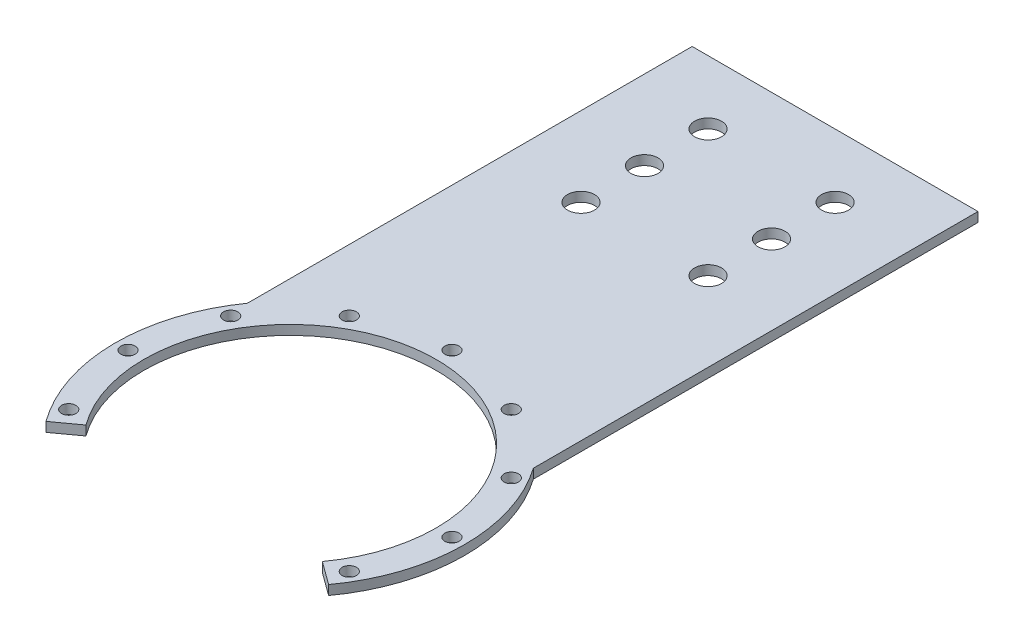
ISO-10303-21;
HEADER;
FILE_DESCRIPTION(('STEP AP214'),'2;1');
FILE_NAME('part.step','',(''),(''),'','','');
FILE_SCHEMA(('AUTOMOTIVE_DESIGN { 1 0 10303 214 1 1 1 1 }'));
ENDSEC;
DATA;
#1=APPLICATION_CONTEXT('core data for automotive mechanical design processes');
#2=APPLICATION_PROTOCOL_DEFINITION('international standard','automotive_design',2000,#1);
#3=PRODUCT_CONTEXT('',#1,'mechanical');
#4=PRODUCT('Part','Part','',(#3));
#5=PRODUCT_RELATED_PRODUCT_CATEGORY('part','',(#4));
#6=PRODUCT_DEFINITION_FORMATION('','',#4);
#7=PRODUCT_DEFINITION_CONTEXT('part definition',#1,'design');
#8=PRODUCT_DEFINITION('design','',#6,#7);
#9=PRODUCT_DEFINITION_SHAPE('','',#8);
#10=(LENGTH_UNIT() NAMED_UNIT(*) SI_UNIT(.MILLI.,.METRE.));
#11=(NAMED_UNIT(*) PLANE_ANGLE_UNIT() SI_UNIT($,.RADIAN.));
#12=(NAMED_UNIT(*) SI_UNIT($,.STERADIAN.) SOLID_ANGLE_UNIT());
#13=UNCERTAINTY_MEASURE_WITH_UNIT(LENGTH_MEASURE(1.E-05),#10,'distance_accuracy_value','');
#14=(GEOMETRIC_REPRESENTATION_CONTEXT(3) GLOBAL_UNCERTAINTY_ASSIGNED_CONTEXT((#13)) GLOBAL_UNIT_ASSIGNED_CONTEXT((#10,
#11,#12)) REPRESENTATION_CONTEXT('',''));
#15=CARTESIAN_POINT('',(0.,0.,0.));
#16=DIRECTION('',(0.,0.,1.));
#17=DIRECTION('',(1.,0.,0.));
#18=AXIS2_PLACEMENT_3D('',#15,#16,#17);
#19=CARTESIAN_POINT('',(-20.,-0.000287499999999594,-111.622776601684));
#20=DIRECTION('',(0.,1.,0.));
#21=DIRECTION('',(0.,0.,1.));
#22=AXIS2_PLACEMENT_3D('',#19,#20,#21);
#23=CYLINDRICAL_SURFACE('',#22,4.25);
#24=CARTESIAN_POINT('',(-20.,3.,-111.622776601684));
#25=DIRECTION('',(0.,1.,0.));
#26=DIRECTION('',(0.,0.,1.));
#27=AXIS2_PLACEMENT_3D('',#24,#25,#26);
#28=CIRCLE('',#27,4.25);
#29=CARTESIAN_POINT('',(-20.,3.,-107.372776601684));
#30=VERTEX_POINT('',#29);
#31=EDGE_CURVE('E40',#30,#30,#28,.T.);
#32=ORIENTED_EDGE('',*,*,#31,.T.);
#33=EDGE_LOOP('',(#32));
#34=FACE_BOUND('',#33,.T.);
#35=CARTESIAN_POINT('',(-20.,0.,-111.622776601684));
#36=DIRECTION('',(0.,1.,0.));
#37=DIRECTION('',(0.,0.,1.));
#38=AXIS2_PLACEMENT_3D('',#35,#36,#37);
#39=CIRCLE('',#38,4.25);
#40=CARTESIAN_POINT('',(-20.,0.,-107.372776601684));
#41=VERTEX_POINT('',#40);
#42=EDGE_CURVE('E11',#41,#41,#39,.T.);
#43=ORIENTED_EDGE('',*,*,#42,.F.);
#44=EDGE_LOOP('',(#43));
#45=FACE_BOUND('',#44,.T.);
#46=ADVANCED_FACE('F33',(#34,#45),#23,.F.);
#47=CARTESIAN_POINT('',(20.,-0.000287499999999594,-111.622776601684));
#48=DIRECTION('',(0.,1.,0.));
#49=DIRECTION('',(0.,0.,1.));
#50=AXIS2_PLACEMENT_3D('',#47,#48,#49);
#51=CYLINDRICAL_SURFACE('',#50,4.25);
#52=CARTESIAN_POINT('',(20.,3.,-111.622776601684));
#53=DIRECTION('',(0.,1.,0.));
#54=DIRECTION('',(0.,0.,1.));
#55=AXIS2_PLACEMENT_3D('',#52,#53,#54);
#56=CIRCLE('',#55,4.25);
#57=CARTESIAN_POINT('',(20.,3.,-107.372776601684));
#58=VERTEX_POINT('',#57);
#59=EDGE_CURVE('E144',#58,#58,#56,.T.);
#60=ORIENTED_EDGE('',*,*,#59,.T.);
#61=EDGE_LOOP('',(#60));
#62=FACE_BOUND('',#61,.T.);
#63=CARTESIAN_POINT('',(20.,0.,-111.622776601684));
#64=DIRECTION('',(0.,1.,0.));
#65=DIRECTION('',(0.,0.,1.));
#66=AXIS2_PLACEMENT_3D('',#63,#64,#65);
#67=CIRCLE('',#66,4.25);
#68=CARTESIAN_POINT('',(20.,0.,-107.372776601684));
#69=VERTEX_POINT('',#68);
#70=EDGE_CURVE('E146',#69,#69,#67,.T.);
#71=ORIENTED_EDGE('',*,*,#70,.F.);
#72=EDGE_LOOP('',(#71));
#73=FACE_BOUND('',#72,.T.);
#74=ADVANCED_FACE('F171',(#62,#73),#51,.F.);
#75=CARTESIAN_POINT('',(0.,3.,0.));
#76=DIRECTION('',(0.,-1.,0.));
#77=DIRECTION('',(0.,0.,-1.));
#78=AXIS2_PLACEMENT_3D('',#75,#76,#77);
#79=CYLINDRICAL_SURFACE('',#78,55.);
#80=DIRECTION('',(0.,1.,0.));
#81=VECTOR('',#80,1.);
#82=CARTESIAN_POINT('',(44.4959346906222,-2.49999999998515E-05,32.328188876086));
#83=LINE('',#82,#81);
#84=CARTESIAN_POINT('',(44.4959346906222,-6.24999999996288E-06,32.328188876086));
#85=VERTEX_POINT('',#84);
#86=CARTESIAN_POINT('',(44.4959346906222,3.,32.328188876086));
#87=VERTEX_POINT('',#86);
#88=EDGE_CURVE('E97',#85,#87,#83,.T.);
#89=ORIENTED_EDGE('',*,*,#88,.F.);
#90=CARTESIAN_POINT('',(0.,0.,0.));
#91=DIRECTION('',(0.,1.,0.));
#92=DIRECTION('',(0.,0.,1.));
#93=AXIS2_PLACEMENT_3D('',#90,#91,#92);
#94=CIRCLE('',#93,55.);
#95=CARTESIAN_POINT('',(45.,0.,-31.6227766016838));
#96=VERTEX_POINT('',#95);
#97=EDGE_CURVE('E126',#85,#96,#94,.T.);
#98=ORIENTED_EDGE('',*,*,#97,.T.);
#99=DIRECTION('',(0.,-1.,0.));
#100=VECTOR('',#99,1.);
#101=CARTESIAN_POINT('',(45.,3.,-31.6227766016838));
#102=LINE('',#101,#100);
#103=CARTESIAN_POINT('',(45.,3.,-31.6227766016838));
#104=VERTEX_POINT('',#103);
#105=EDGE_CURVE('E117',#104,#96,#102,.T.);
#106=ORIENTED_EDGE('',*,*,#105,.F.);
#107=CARTESIAN_POINT('',(0.,3.,0.));
#108=DIRECTION('',(0.,1.,0.));
#109=DIRECTION('',(0.,0.,1.));
#110=AXIS2_PLACEMENT_3D('',#107,#108,#109);
#111=CIRCLE('',#110,55.);
#112=EDGE_CURVE('E109',#87,#104,#111,.T.);
#113=ORIENTED_EDGE('',*,*,#112,.F.);
#114=EDGE_LOOP('',(#89,#98,#106,#113));
#115=FACE_BOUND('',#114,.T.);
#116=ADVANCED_FACE('F115',(#115),#79,.T.);
#117=CARTESIAN_POINT('',(0.,3.,0.));
#118=DIRECTION('',(0.,1.,0.));
#119=DIRECTION('',(0.,0.,1.));
#120=AXIS2_PLACEMENT_3D('',#117,#118,#119);
#121=PLANE('',#120);
#122=CARTESIAN_POINT('',(-20.,3.,-131.622776601684));
#123=DIRECTION('',(0.,1.,0.));
#124=DIRECTION('',(0.,0.,1.));
#125=AXIS2_PLACEMENT_3D('',#122,#123,#124);
#126=CIRCLE('',#125,4.25);
#127=CARTESIAN_POINT('',(-20.,3.,-127.372776601684));
#128=VERTEX_POINT('',#127);
#129=EDGE_CURVE('E549',#128,#128,#126,.T.);
#130=ORIENTED_EDGE('',*,*,#129,.F.);
#131=EDGE_LOOP('',(#130));
#132=FACE_BOUND('',#131,.T.);
#133=CARTESIAN_POINT('',(20.,3.,-131.622776601684));
#134=DIRECTION('',(0.,1.,0.));
#135=DIRECTION('',(0.,0.,1.));
#136=AXIS2_PLACEMENT_3D('',#133,#134,#135);
#137=CIRCLE('',#136,4.25);
#138=CARTESIAN_POINT('',(20.,3.,-127.372776601684));
#139=VERTEX_POINT('',#138);
#140=EDGE_CURVE('E447',#139,#139,#137,.T.);
#141=ORIENTED_EDGE('',*,*,#140,.F.);
#142=EDGE_LOOP('',(#141));
#143=FACE_BOUND('',#142,.T.);
#144=CARTESIAN_POINT('',(20.,3.,-151.622776601684));
#145=DIRECTION('',(0.,1.,0.));
#146=DIRECTION('',(0.,0.,1.));
#147=AXIS2_PLACEMENT_3D('',#144,#145,#146);
#148=CIRCLE('',#147,4.25);
#149=CARTESIAN_POINT('',(20.,3.,-147.372776601684));
#150=VERTEX_POINT('',#149);
#151=EDGE_CURVE('E411',#150,#150,#148,.T.);
#152=ORIENTED_EDGE('',*,*,#151,.F.);
#153=EDGE_LOOP('',(#152));
#154=FACE_BOUND('',#153,.T.);
#155=CARTESIAN_POINT('',(-20.,3.,-151.622776601684));
#156=DIRECTION('',(0.,1.,0.));
#157=DIRECTION('',(0.,0.,1.));
#158=AXIS2_PLACEMENT_3D('',#155,#156,#157);
#159=CIRCLE('',#158,4.25);
#160=CARTESIAN_POINT('',(-20.,3.,-147.372776601684));
#161=VERTEX_POINT('',#160);
#162=EDGE_CURVE('E440',#161,#161,#159,.T.);
#163=ORIENTED_EDGE('',*,*,#162,.F.);
#164=EDGE_LOOP('',(#163));
#165=FACE_BOUND('',#164,.T.);
#166=CARTESIAN_POINT('',(-44.1672955930064,3.,-25.4999999999999));
#167=DIRECTION('',(0.,1.,0.));
#168=DIRECTION('',(0.,0.,1.));
#169=AXIS2_PLACEMENT_3D('',#166,#167,#168);
#170=CIRCLE('',#169,2.25);
#171=CARTESIAN_POINT('',(-44.1672955930064,3.,-23.2499999999999));
#172=VERTEX_POINT('',#171);
#173=EDGE_CURVE('E406',#172,#172,#170,.T.);
#174=ORIENTED_EDGE('',*,*,#173,.F.);
#175=EDGE_LOOP('',(#174));
#176=FACE_BOUND('',#175,.T.);
#177=CARTESIAN_POINT('',(-51.,3.,1.78065548281E-13));
#178=DIRECTION('',(0.,1.,0.));
#179=DIRECTION('',(0.,0.,1.));
#180=AXIS2_PLACEMENT_3D('',#177,#178,#179);
#181=CIRCLE('',#180,2.25);
#182=CARTESIAN_POINT('',(-51.,3.,2.25000000000018));
#183=VERTEX_POINT('',#182);
#184=EDGE_CURVE('E435',#183,#183,#181,.T.);
#185=ORIENTED_EDGE('',*,*,#184,.F.);
#186=EDGE_LOOP('',(#185));
#187=FACE_BOUND('',#186,.T.);
#188=CARTESIAN_POINT('',(-44.1672955930063,3.,25.5000000000002));
#189=DIRECTION('',(0.,1.,0.));
#190=DIRECTION('',(0.,0.,1.));
#191=AXIS2_PLACEMENT_3D('',#188,#189,#190);
#192=CIRCLE('',#191,2.25);
#193=CARTESIAN_POINT('',(-44.1672955930063,3.,27.7500000000002));
#194=VERTEX_POINT('',#193);
#195=EDGE_CURVE('E431',#194,#194,#192,.T.);
#196=ORIENTED_EDGE('',*,*,#195,.F.);
#197=EDGE_LOOP('',(#196));
#198=FACE_BOUND('',#197,.T.);
#199=CARTESIAN_POINT('',(44.1672955930066,3.,25.4999999999996));
#200=DIRECTION('',(0.,1.,0.));
#201=DIRECTION('',(0.,0.,1.));
#202=AXIS2_PLACEMENT_3D('',#199,#200,#201);
#203=CIRCLE('',#202,2.25);
#204=CARTESIAN_POINT('',(44.1672955930066,3.,27.7499999999996));
#205=VERTEX_POINT('',#204);
#206=EDGE_CURVE('E427',#205,#205,#203,.T.);
#207=ORIENTED_EDGE('',*,*,#206,.F.);
#208=EDGE_LOOP('',(#207));
#209=FACE_BOUND('',#208,.T.);
#210=CARTESIAN_POINT('',(51.,3.,-5.34196644842999E-13));
#211=DIRECTION('',(0.,1.,0.));
#212=DIRECTION('',(0.,0.,1.));
#213=AXIS2_PLACEMENT_3D('',#210,#211,#212);
#214=CIRCLE('',#213,2.25);
#215=CARTESIAN_POINT('',(51.,3.,2.24999999999947));
#216=VERTEX_POINT('',#215);
#217=EDGE_CURVE('E423',#216,#216,#214,.T.);
#218=ORIENTED_EDGE('',*,*,#217,.F.);
#219=EDGE_LOOP('',(#218));
#220=FACE_BOUND('',#219,.T.);
#221=CARTESIAN_POINT('',(44.1672955930061,3.,-25.5000000000005));
#222=DIRECTION('',(0.,1.,0.));
#223=DIRECTION('',(0.,0.,1.));
#224=AXIS2_PLACEMENT_3D('',#221,#222,#223);
#225=CIRCLE('',#224,2.25);
#226=CARTESIAN_POINT('',(44.1672955930061,3.,-23.2500000000005));
#227=VERTEX_POINT('',#226);
#228=EDGE_CURVE('E419',#227,#227,#225,.T.);
#229=ORIENTED_EDGE('',*,*,#228,.F.);
#230=EDGE_LOOP('',(#229));
#231=FACE_BOUND('',#230,.T.);
#232=CARTESIAN_POINT('',(25.4999999999994,3.,-44.1672955930067));
#233=DIRECTION('',(0.,1.,0.));
#234=DIRECTION('',(0.,0.,1.));
#235=AXIS2_PLACEMENT_3D('',#232,#233,#234);
#236=CIRCLE('',#235,2.25);
#237=CARTESIAN_POINT('',(25.4999999999994,3.,-41.9172955930067));
#238=VERTEX_POINT('',#237);
#239=EDGE_CURVE('E415',#238,#238,#236,.T.);
#240=ORIENTED_EDGE('',*,*,#239,.F.);
#241=EDGE_LOOP('',(#240));
#242=FACE_BOUND('',#241,.T.);
#243=CARTESIAN_POINT('',(-25.5,3.,-44.1672955930063));
#244=DIRECTION('',(0.,1.,0.));
#245=DIRECTION('',(0.,0.,1.));
#246=AXIS2_PLACEMENT_3D('',#243,#244,#245);
#247=CIRCLE('',#246,2.25);
#248=CARTESIAN_POINT('',(-25.5,3.,-41.9172955930063));
#249=VERTEX_POINT('',#248);
#250=EDGE_CURVE('E410',#249,#249,#247,.T.);
#251=ORIENTED_EDGE('',*,*,#250,.F.);
#252=EDGE_LOOP('',(#251));
#253=FACE_BOUND('',#252,.T.);
#254=CARTESIAN_POINT('',(0.,3.,-51.));
#255=DIRECTION('',(0.,1.,0.));
#256=DIRECTION('',(0.,0.,1.));
#257=AXIS2_PLACEMENT_3D('',#254,#255,#256);
#258=CIRCLE('',#257,2.25);
#259=CARTESIAN_POINT('',(0.,3.,-48.75));
#260=VERTEX_POINT('',#259);
#261=EDGE_CURVE('E103',#260,#260,#258,.T.);
#262=ORIENTED_EDGE('',*,*,#261,.F.);
#263=EDGE_LOOP('',(#262));
#264=FACE_BOUND('',#263,.T.);
#265=CARTESIAN_POINT('',(0.,3.,0.));
#266=DIRECTION('',(0.,1.,0.));
#267=DIRECTION('',(0.,0.,1.));
#268=AXIS2_PLACEMENT_3D('',#265,#266,#267);
#269=CIRCLE('',#268,46.);
#270=CARTESIAN_POINT('',(37.2147817412476,3.,27.0381216054537));
#271=VERTEX_POINT('',#270);
#272=CARTESIAN_POINT('',(-37.2147817412476,3.,27.0381216054537));
#273=VERTEX_POINT('',#272);
#274=EDGE_CURVE('E112',#271,#273,#269,.T.);
#275=ORIENTED_EDGE('',*,*,#274,.F.);
#276=DIRECTION('',(0.809016994374949,0.,0.587785252292472));
#277=VECTOR('',#276,1.);
#278=CARTESIAN_POINT('',(0.,3.,0.));
#279=LINE('',#278,#277);
#280=EDGE_CURVE('E47',#271,#87,#279,.T.);
#281=ORIENTED_EDGE('',*,*,#280,.T.);
#282=ORIENTED_EDGE('',*,*,#112,.T.);
#283=DIRECTION('',(0.,0.,-1.));
#284=VECTOR('',#283,1.);
#285=CARTESIAN_POINT('',(45.,3.,-171.622776601684));
#286=LINE('',#285,#284);
#287=CARTESIAN_POINT('',(45.,3.,-171.622776601684));
#288=VERTEX_POINT('',#287);
#289=EDGE_CURVE('E393',#104,#288,#286,.T.);
#290=ORIENTED_EDGE('',*,*,#289,.T.);
#291=DIRECTION('',(-1.,0.,0.));
#292=VECTOR('',#291,1.);
#293=CARTESIAN_POINT('',(-45.,3.,-171.622776601684));
#294=LINE('',#293,#292);
#295=CARTESIAN_POINT('',(-45.,3.,-171.622776601684));
#296=VERTEX_POINT('',#295);
#297=EDGE_CURVE('E397',#288,#296,#294,.T.);
#298=ORIENTED_EDGE('',*,*,#297,.T.);
#299=DIRECTION('',(0.,0.,1.));
#300=VECTOR('',#299,1.);
#301=CARTESIAN_POINT('',(-45.,3.,-171.622776601684));
#302=LINE('',#301,#300);
#303=CARTESIAN_POINT('',(-45.,3.,-31.6227766016838));
#304=VERTEX_POINT('',#303);
#305=EDGE_CURVE('E491',#296,#304,#302,.T.);
#306=ORIENTED_EDGE('',*,*,#305,.T.);
#307=CARTESIAN_POINT('',(-44.4959346906222,3.,32.328188876086));
#308=VERTEX_POINT('',#307);
#309=EDGE_CURVE('E119',#304,#308,#111,.T.);
#310=ORIENTED_EDGE('',*,*,#309,.T.);
#311=DIRECTION('',(-0.809016994374949,0.,0.587785252292472));
#312=VECTOR('',#311,1.);
#313=CARTESIAN_POINT('',(0.,3.,0.));
#314=LINE('',#313,#312);
#315=EDGE_CURVE('E483',#273,#308,#314,.T.);
#316=ORIENTED_EDGE('',*,*,#315,.F.);
#317=EDGE_LOOP('',(#275,#281,#282,#290,#298,#306,#310,#316));
#318=FACE_BOUND('',#317,.T.);
#319=ORIENTED_EDGE('',*,*,#59,.F.);
#320=EDGE_LOOP('',(#319));
#321=FACE_BOUND('',#320,.T.);
#322=ORIENTED_EDGE('',*,*,#31,.F.);
#323=EDGE_LOOP('',(#322));
#324=FACE_BOUND('',#323,.T.);
#325=ADVANCED_FACE('F107',(#132,#143,#154,#165,#176,#187,#198,#209,#220,#231,#242,#253,#264,
#318,#321,#324),#121,.T.);
#326=CARTESIAN_POINT('',(0.,0.,0.));
#327=DIRECTION('',(0.,1.,0.));
#328=DIRECTION('',(0.,0.,1.));
#329=AXIS2_PLACEMENT_3D('',#326,#327,#328);
#330=PLANE('',#329);
#331=CARTESIAN_POINT('',(-20.,0.,-131.622776601684));
#332=DIRECTION('',(0.,1.,0.));
#333=DIRECTION('',(0.,0.,1.));
#334=AXIS2_PLACEMENT_3D('',#331,#332,#333);
#335=CIRCLE('',#334,4.25);
#336=CARTESIAN_POINT('',(-20.,0.,-127.372776601684));
#337=VERTEX_POINT('',#336);
#338=EDGE_CURVE('E452',#337,#337,#335,.T.);
#339=ORIENTED_EDGE('',*,*,#338,.T.);
#340=EDGE_LOOP('',(#339));
#341=FACE_BOUND('',#340,.T.);
#342=CARTESIAN_POINT('',(20.,0.,-131.622776601684));
#343=DIRECTION('',(0.,1.,0.));
#344=DIRECTION('',(0.,0.,1.));
#345=AXIS2_PLACEMENT_3D('',#342,#343,#344);
#346=CIRCLE('',#345,4.25);
#347=CARTESIAN_POINT('',(20.,0.,-127.372776601684));
#348=VERTEX_POINT('',#347);
#349=EDGE_CURVE('E441',#348,#348,#346,.T.);
#350=ORIENTED_EDGE('',*,*,#349,.T.);
#351=EDGE_LOOP('',(#350));
#352=FACE_BOUND('',#351,.T.);
#353=CARTESIAN_POINT('',(20.,0.,-151.622776601684));
#354=DIRECTION('',(0.,1.,0.));
#355=DIRECTION('',(0.,0.,1.));
#356=AXIS2_PLACEMENT_3D('',#353,#354,#355);
#357=CIRCLE('',#356,4.25);
#358=CARTESIAN_POINT('',(20.,0.,-147.372776601684));
#359=VERTEX_POINT('',#358);
#360=EDGE_CURVE('E153',#359,#359,#357,.T.);
#361=ORIENTED_EDGE('',*,*,#360,.T.);
#362=EDGE_LOOP('',(#361));
#363=FACE_BOUND('',#362,.T.);
#364=CARTESIAN_POINT('',(-20.,0.,-151.622776601684));
#365=DIRECTION('',(0.,1.,0.));
#366=DIRECTION('',(0.,0.,1.));
#367=AXIS2_PLACEMENT_3D('',#364,#365,#366);
#368=CIRCLE('',#367,4.25);
#369=CARTESIAN_POINT('',(-20.,0.,-147.372776601684));
#370=VERTEX_POINT('',#369);
#371=EDGE_CURVE('E438',#370,#370,#368,.T.);
#372=ORIENTED_EDGE('',*,*,#371,.T.);
#373=EDGE_LOOP('',(#372));
#374=FACE_BOUND('',#373,.T.);
#375=CARTESIAN_POINT('',(-44.1672955930064,0.,-25.4999999999999));
#376=DIRECTION('',(0.,1.,0.));
#377=DIRECTION('',(0.,0.,1.));
#378=AXIS2_PLACEMENT_3D('',#375,#376,#377);
#379=CIRCLE('',#378,2.25);
#380=CARTESIAN_POINT('',(-44.1672955930064,0.,-23.2499999999999));
#381=VERTEX_POINT('',#380);
#382=EDGE_CURVE('E436',#381,#381,#379,.T.);
#383=ORIENTED_EDGE('',*,*,#382,.T.);
#384=EDGE_LOOP('',(#383));
#385=FACE_BOUND('',#384,.T.);
#386=CARTESIAN_POINT('',(-51.,0.,1.78065548281E-13));
#387=DIRECTION('',(0.,1.,0.));
#388=DIRECTION('',(0.,0.,1.));
#389=AXIS2_PLACEMENT_3D('',#386,#387,#388);
#390=CIRCLE('',#389,2.25);
#391=CARTESIAN_POINT('',(-51.,0.,2.25000000000018));
#392=VERTEX_POINT('',#391);
#393=EDGE_CURVE('E432',#392,#392,#390,.T.);
#394=ORIENTED_EDGE('',*,*,#393,.T.);
#395=EDGE_LOOP('',(#394));
#396=FACE_BOUND('',#395,.T.);
#397=CARTESIAN_POINT('',(-44.1672955930063,0.,25.5000000000002));
#398=DIRECTION('',(0.,1.,0.));
#399=DIRECTION('',(0.,0.,1.));
#400=AXIS2_PLACEMENT_3D('',#397,#398,#399);
#401=CIRCLE('',#400,2.25);
#402=CARTESIAN_POINT('',(-44.1672955930063,0.,27.7500000000002));
#403=VERTEX_POINT('',#402);
#404=EDGE_CURVE('E428',#403,#403,#401,.T.);
#405=ORIENTED_EDGE('',*,*,#404,.T.);
#406=EDGE_LOOP('',(#405));
#407=FACE_BOUND('',#406,.T.);
#408=CARTESIAN_POINT('',(44.1672955930066,0.,25.4999999999996));
#409=DIRECTION('',(0.,1.,0.));
#410=DIRECTION('',(0.,0.,1.));
#411=AXIS2_PLACEMENT_3D('',#408,#409,#410);
#412=CIRCLE('',#411,2.25);
#413=CARTESIAN_POINT('',(44.1672955930066,0.,27.7499999999996));
#414=VERTEX_POINT('',#413);
#415=EDGE_CURVE('E424',#414,#414,#412,.T.);
#416=ORIENTED_EDGE('',*,*,#415,.T.);
#417=EDGE_LOOP('',(#416));
#418=FACE_BOUND('',#417,.T.);
#419=CARTESIAN_POINT('',(51.,0.,-5.34196644842999E-13));
#420=DIRECTION('',(0.,1.,0.));
#421=DIRECTION('',(0.,0.,1.));
#422=AXIS2_PLACEMENT_3D('',#419,#420,#421);
#423=CIRCLE('',#422,2.25);
#424=CARTESIAN_POINT('',(51.,0.,2.24999999999947));
#425=VERTEX_POINT('',#424);
#426=EDGE_CURVE('E420',#425,#425,#423,.T.);
#427=ORIENTED_EDGE('',*,*,#426,.T.);
#428=EDGE_LOOP('',(#427));
#429=FACE_BOUND('',#428,.T.);
#430=CARTESIAN_POINT('',(44.1672955930061,0.,-25.5000000000005));
#431=DIRECTION('',(0.,1.,0.));
#432=DIRECTION('',(0.,0.,1.));
#433=AXIS2_PLACEMENT_3D('',#430,#431,#432);
#434=CIRCLE('',#433,2.25);
#435=CARTESIAN_POINT('',(44.1672955930061,0.,-23.2500000000005));
#436=VERTEX_POINT('',#435);
#437=EDGE_CURVE('E416',#436,#436,#434,.T.);
#438=ORIENTED_EDGE('',*,*,#437,.T.);
#439=EDGE_LOOP('',(#438));
#440=FACE_BOUND('',#439,.T.);
#441=CARTESIAN_POINT('',(25.4999999999994,0.,-44.1672955930067));
#442=DIRECTION('',(0.,1.,0.));
#443=DIRECTION('',(0.,0.,1.));
#444=AXIS2_PLACEMENT_3D('',#441,#442,#443);
#445=CIRCLE('',#444,2.25);
#446=CARTESIAN_POINT('',(25.4999999999994,0.,-41.9172955930067));
#447=VERTEX_POINT('',#446);
#448=EDGE_CURVE('E412',#447,#447,#445,.T.);
#449=ORIENTED_EDGE('',*,*,#448,.T.);
#450=EDGE_LOOP('',(#449));
#451=FACE_BOUND('',#450,.T.);
#452=CARTESIAN_POINT('',(-25.5,0.,-44.1672955930063));
#453=DIRECTION('',(0.,1.,0.));
#454=DIRECTION('',(0.,0.,1.));
#455=AXIS2_PLACEMENT_3D('',#452,#453,#454);
#456=CIRCLE('',#455,2.25);
#457=CARTESIAN_POINT('',(-25.5,0.,-41.9172955930063));
#458=VERTEX_POINT('',#457);
#459=EDGE_CURVE('E407',#458,#458,#456,.T.);
#460=ORIENTED_EDGE('',*,*,#459,.T.);
#461=EDGE_LOOP('',(#460));
#462=FACE_BOUND('',#461,.T.);
#463=CARTESIAN_POINT('',(0.,0.,-51.));
#464=DIRECTION('',(0.,1.,0.));
#465=DIRECTION('',(0.,0.,1.));
#466=AXIS2_PLACEMENT_3D('',#463,#464,#465);
#467=CIRCLE('',#466,2.25);
#468=CARTESIAN_POINT('',(0.,0.,-48.75));
#469=VERTEX_POINT('',#468);
#470=EDGE_CURVE('E403',#469,#469,#467,.T.);
#471=ORIENTED_EDGE('',*,*,#470,.T.);
#472=EDGE_LOOP('',(#471));
#473=FACE_BOUND('',#472,.T.);
#474=DIRECTION('',(0.809016994374949,0.,0.587785252292472));
#475=VECTOR('',#474,1.);
#476=CARTESIAN_POINT('',(0.,0.,0.));
#477=LINE('',#476,#475);
#478=CARTESIAN_POINT('',(37.2147817412476,0.,27.0381216054537));
#479=VERTEX_POINT('',#478);
#480=EDGE_CURVE('E99',#479,#85,#477,.T.);
#481=ORIENTED_EDGE('',*,*,#480,.F.);
#482=CARTESIAN_POINT('',(0.,0.,0.));
#483=DIRECTION('',(0.,1.,0.));
#484=DIRECTION('',(0.,0.,1.));
#485=AXIS2_PLACEMENT_3D('',#482,#483,#484);
#486=CIRCLE('',#485,46.);
#487=CARTESIAN_POINT('',(-37.2147817412476,0.,27.0381216054537));
#488=VERTEX_POINT('',#487);
#489=EDGE_CURVE('E55',#479,#488,#486,.T.);
#490=ORIENTED_EDGE('',*,*,#489,.T.);
#491=DIRECTION('',(-0.809016994374949,0.,0.587785252292472));
#492=VECTOR('',#491,1.);
#493=CARTESIAN_POINT('',(0.,0.,0.));
#494=LINE('',#493,#492);
#495=CARTESIAN_POINT('',(-44.4959346906222,0.,32.328188876086));
#496=VERTEX_POINT('',#495);
#497=EDGE_CURVE('E113',#488,#496,#494,.T.);
#498=ORIENTED_EDGE('',*,*,#497,.T.);
#499=CARTESIAN_POINT('',(-45.,0.,-31.6227766016838));
#500=VERTEX_POINT('',#499);
#501=EDGE_CURVE('E120',#500,#496,#94,.T.);
#502=ORIENTED_EDGE('',*,*,#501,.F.);
#503=DIRECTION('',(0.,0.,1.));
#504=VECTOR('',#503,1.);
#505=CARTESIAN_POINT('',(-45.,0.,-171.622776601684));
#506=LINE('',#505,#504);
#507=CARTESIAN_POINT('',(-45.,0.,-171.622776601684));
#508=VERTEX_POINT('',#507);
#509=EDGE_CURVE('E386',#508,#500,#506,.T.);
#510=ORIENTED_EDGE('',*,*,#509,.F.);
#511=DIRECTION('',(-1.,0.,0.));
#512=VECTOR('',#511,1.);
#513=CARTESIAN_POINT('',(-45.,0.,-171.622776601684));
#514=LINE('',#513,#512);
#515=CARTESIAN_POINT('',(45.,0.,-171.622776601684));
#516=VERTEX_POINT('',#515);
#517=EDGE_CURVE('E380',#516,#508,#514,.T.);
#518=ORIENTED_EDGE('',*,*,#517,.F.);
#519=DIRECTION('',(0.,0.,-1.));
#520=VECTOR('',#519,1.);
#521=CARTESIAN_POINT('',(45.,0.,-171.622776601684));
#522=LINE('',#521,#520);
#523=EDGE_CURVE('E389',#96,#516,#522,.T.);
#524=ORIENTED_EDGE('',*,*,#523,.F.);
#525=ORIENTED_EDGE('',*,*,#97,.F.);
#526=EDGE_LOOP('',(#481,#490,#498,#502,#510,#518,#524,#525));
#527=FACE_BOUND('',#526,.T.);
#528=ORIENTED_EDGE('',*,*,#70,.T.);
#529=EDGE_LOOP('',(#528));
#530=FACE_BOUND('',#529,.T.);
#531=ORIENTED_EDGE('',*,*,#42,.T.);
#532=EDGE_LOOP('',(#531));
#533=FACE_BOUND('',#532,.T.);
#534=ADVANCED_FACE('F161',(#341,#352,#363,#374,#385,#396,#407,#418,#429,#440,#451,#462,#473,
#527,#530,#533),#330,.F.);
#535=CARTESIAN_POINT('',(0.,0.,0.));
#536=DIRECTION('',(0.,1.,0.));
#537=DIRECTION('',(0.,0.,1.));
#538=AXIS2_PLACEMENT_3D('',#535,#536,#537);
#539=CYLINDRICAL_SURFACE('',#538,46.);
#540=DIRECTION('',(0.,1.,0.));
#541=VECTOR('',#540,1.);
#542=CARTESIAN_POINT('',(37.2147817412476,0.,27.0381216054537));
#543=LINE('',#542,#541);
#544=EDGE_CURVE('E131',#271,#479,#543,.F.);
#545=ORIENTED_EDGE('',*,*,#544,.F.);
#546=ORIENTED_EDGE('',*,*,#274,.T.);
#547=DIRECTION('',(0.,1.,0.));
#548=VECTOR('',#547,1.);
#549=CARTESIAN_POINT('',(-37.2147817412476,0.,27.0381216054537));
#550=LINE('',#549,#548);
#551=EDGE_CURVE('E123',#273,#488,#550,.F.);
#552=ORIENTED_EDGE('',*,*,#551,.T.);
#553=ORIENTED_EDGE('',*,*,#489,.F.);
#554=EDGE_LOOP('',(#545,#546,#552,#553));
#555=FACE_BOUND('',#554,.T.);
#556=ADVANCED_FACE('F168',(#555),#539,.F.);
#557=ORIENTED_EDGE('',*,*,#501,.T.);
#558=DIRECTION('',(0.,1.,0.));
#559=VECTOR('',#558,1.);
#560=CARTESIAN_POINT('',(-44.4959346906222,0.,32.328188876086));
#561=LINE('',#560,#559);
#562=EDGE_CURVE('E480',#496,#308,#561,.T.);
#563=ORIENTED_EDGE('',*,*,#562,.T.);
#564=ORIENTED_EDGE('',*,*,#309,.F.);
#565=DIRECTION('',(0.,-1.,0.));
#566=VECTOR('',#565,1.);
#567=CARTESIAN_POINT('',(-45.,3.,-31.6227766016838));
#568=LINE('',#567,#566);
#569=EDGE_CURVE('E399',#304,#500,#568,.T.);
#570=ORIENTED_EDGE('',*,*,#569,.T.);
#571=EDGE_LOOP('',(#557,#563,#564,#570));
#572=FACE_BOUND('',#571,.T.);
#573=ADVANCED_FACE('F173',(#572),#79,.T.);
#574=CARTESIAN_POINT('',(-45.,3.,-171.622776601684));
#575=DIRECTION('',(0.,0.,1.));
#576=DIRECTION('',(1.,0.,0.));
#577=AXIS2_PLACEMENT_3D('',#574,#575,#576);
#578=PLANE('',#577);
#579=ORIENTED_EDGE('',*,*,#517,.T.);
#580=DIRECTION('',(0.,-1.,0.));
#581=VECTOR('',#580,1.);
#582=CARTESIAN_POINT('',(-45.,3.,-171.622776601684));
#583=LINE('',#582,#581);
#584=EDGE_CURVE('E136',#296,#508,#583,.T.);
#585=ORIENTED_EDGE('',*,*,#584,.F.);
#586=ORIENTED_EDGE('',*,*,#297,.F.);
#587=DIRECTION('',(0.,-1.,0.));
#588=VECTOR('',#587,1.);
#589=CARTESIAN_POINT('',(45.,3.,-171.622776601684));
#590=LINE('',#589,#588);
#591=EDGE_CURVE('E384',#288,#516,#590,.T.);
#592=ORIENTED_EDGE('',*,*,#591,.T.);
#593=EDGE_LOOP('',(#579,#585,#586,#592));
#594=FACE_BOUND('',#593,.T.);
#595=ADVANCED_FACE('F369',(#594),#578,.F.);
#596=CARTESIAN_POINT('',(-45.,3.,-171.622776601684));
#597=DIRECTION('',(1.,0.,0.));
#598=DIRECTION('',(0.,0.,-1.));
#599=AXIS2_PLACEMENT_3D('',#596,#597,#598);
#600=PLANE('',#599);
#601=ORIENTED_EDGE('',*,*,#509,.T.);
#602=ORIENTED_EDGE('',*,*,#569,.F.);
#603=ORIENTED_EDGE('',*,*,#305,.F.);
#604=ORIENTED_EDGE('',*,*,#584,.T.);
#605=EDGE_LOOP('',(#601,#602,#603,#604));
#606=FACE_BOUND('',#605,.T.);
#607=ADVANCED_FACE('F366',(#606),#600,.F.);
#608=CARTESIAN_POINT('',(45.,3.,-171.622776601684));
#609=DIRECTION('',(-1.,0.,0.));
#610=DIRECTION('',(0.,0.,1.));
#611=AXIS2_PLACEMENT_3D('',#608,#609,#610);
#612=PLANE('',#611);
#613=ORIENTED_EDGE('',*,*,#523,.T.);
#614=ORIENTED_EDGE('',*,*,#591,.F.);
#615=ORIENTED_EDGE('',*,*,#289,.F.);
#616=ORIENTED_EDGE('',*,*,#105,.T.);
#617=EDGE_LOOP('',(#613,#614,#615,#616));
#618=FACE_BOUND('',#617,.T.);
#619=ADVANCED_FACE('F361',(#618),#612,.F.);
#620=CARTESIAN_POINT('',(0.,0.,0.));
#621=DIRECTION('',(-0.587785252292472,0.,-0.809016994374948));
#622=DIRECTION('',(-0.809016994374949,0.,0.587785252292472));
#623=AXIS2_PLACEMENT_3D('',#620,#621,#622);
#624=PLANE('',#623);
#625=ORIENTED_EDGE('',*,*,#315,.T.);
#626=ORIENTED_EDGE('',*,*,#562,.F.);
#627=ORIENTED_EDGE('',*,*,#497,.F.);
#628=ORIENTED_EDGE('',*,*,#551,.F.);
#629=EDGE_LOOP('',(#625,#626,#627,#628));
#630=FACE_BOUND('',#629,.T.);
#631=ADVANCED_FACE('F200',(#630),#624,.F.);
#632=CARTESIAN_POINT('',(0.,-2.49999999998515E-05,0.));
#633=DIRECTION('',(-0.587785252292472,0.,0.809016994374948));
#634=DIRECTION('',(0.809016994374949,0.,0.587785252292472));
#635=AXIS2_PLACEMENT_3D('',#632,#633,#634);
#636=PLANE('',#635);
#637=ORIENTED_EDGE('',*,*,#544,.T.);
#638=ORIENTED_EDGE('',*,*,#480,.T.);
#639=ORIENTED_EDGE('',*,*,#88,.T.);
#640=ORIENTED_EDGE('',*,*,#280,.F.);
#641=EDGE_LOOP('',(#637,#638,#639,#640));
#642=FACE_BOUND('',#641,.T.);
#643=ADVANCED_FACE('F98',(#642),#636,.T.);
#644=CARTESIAN_POINT('',(0.,-0.000287499999999594,-51.));
#645=DIRECTION('',(0.,1.,0.));
#646=DIRECTION('',(0.,0.,1.));
#647=AXIS2_PLACEMENT_3D('',#644,#645,#646);
#648=CYLINDRICAL_SURFACE('',#647,2.25);
#649=ORIENTED_EDGE('',*,*,#261,.T.);
#650=EDGE_LOOP('',(#649));
#651=FACE_BOUND('',#650,.T.);
#652=ORIENTED_EDGE('',*,*,#470,.F.);
#653=EDGE_LOOP('',(#652));
#654=FACE_BOUND('',#653,.T.);
#655=ADVANCED_FACE('F218',(#651,#654),#648,.F.);
#656=CARTESIAN_POINT('',(-25.5,-0.000287499999999594,-44.1672955930063));
#657=DIRECTION('',(0.,1.,0.));
#658=DIRECTION('',(0.,0.,1.));
#659=AXIS2_PLACEMENT_3D('',#656,#657,#658);
#660=CYLINDRICAL_SURFACE('',#659,2.25);
#661=ORIENTED_EDGE('',*,*,#250,.T.);
#662=EDGE_LOOP('',(#661));
#663=FACE_BOUND('',#662,.T.);
#664=ORIENTED_EDGE('',*,*,#459,.F.);
#665=EDGE_LOOP('',(#664));
#666=FACE_BOUND('',#665,.T.);
#667=ADVANCED_FACE('F227',(#663,#666),#660,.F.);
#668=CARTESIAN_POINT('',(25.4999999999994,-0.000287499999999594,-44.1672955930067));
#669=DIRECTION('',(0.,1.,0.));
#670=DIRECTION('',(0.,0.,1.));
#671=AXIS2_PLACEMENT_3D('',#668,#669,#670);
#672=CYLINDRICAL_SURFACE('',#671,2.25);
#673=ORIENTED_EDGE('',*,*,#239,.T.);
#674=EDGE_LOOP('',(#673));
#675=FACE_BOUND('',#674,.T.);
#676=ORIENTED_EDGE('',*,*,#448,.F.);
#677=EDGE_LOOP('',(#676));
#678=FACE_BOUND('',#677,.T.);
#679=ADVANCED_FACE('F237',(#675,#678),#672,.F.);
#680=CARTESIAN_POINT('',(44.1672955930061,-0.000287499999999594,-25.5000000000005));
#681=DIRECTION('',(0.,1.,0.));
#682=DIRECTION('',(0.,0.,1.));
#683=AXIS2_PLACEMENT_3D('',#680,#681,#682);
#684=CYLINDRICAL_SURFACE('',#683,2.25);
#685=ORIENTED_EDGE('',*,*,#228,.T.);
#686=EDGE_LOOP('',(#685));
#687=FACE_BOUND('',#686,.T.);
#688=ORIENTED_EDGE('',*,*,#437,.F.);
#689=EDGE_LOOP('',(#688));
#690=FACE_BOUND('',#689,.T.);
#691=ADVANCED_FACE('F247',(#687,#690),#684,.F.);
#692=CARTESIAN_POINT('',(51.,-0.000287499999999594,-5.34196644842999E-13));
#693=DIRECTION('',(0.,1.,0.));
#694=DIRECTION('',(0.,0.,1.));
#695=AXIS2_PLACEMENT_3D('',#692,#693,#694);
#696=CYLINDRICAL_SURFACE('',#695,2.25);
#697=ORIENTED_EDGE('',*,*,#217,.T.);
#698=EDGE_LOOP('',(#697));
#699=FACE_BOUND('',#698,.T.);
#700=ORIENTED_EDGE('',*,*,#426,.F.);
#701=EDGE_LOOP('',(#700));
#702=FACE_BOUND('',#701,.T.);
#703=ADVANCED_FACE('F257',(#699,#702),#696,.F.);
#704=CARTESIAN_POINT('',(44.1672955930066,-0.000287499999999594,25.4999999999996));
#705=DIRECTION('',(0.,1.,0.));
#706=DIRECTION('',(0.,0.,1.));
#707=AXIS2_PLACEMENT_3D('',#704,#705,#706);
#708=CYLINDRICAL_SURFACE('',#707,2.25);
#709=ORIENTED_EDGE('',*,*,#206,.T.);
#710=EDGE_LOOP('',(#709));
#711=FACE_BOUND('',#710,.T.);
#712=ORIENTED_EDGE('',*,*,#415,.F.);
#713=EDGE_LOOP('',(#712));
#714=FACE_BOUND('',#713,.T.);
#715=ADVANCED_FACE('F267',(#711,#714),#708,.F.);
#716=CARTESIAN_POINT('',(-44.1672955930063,-0.000287499999999594,25.5000000000002));
#717=DIRECTION('',(0.,1.,0.));
#718=DIRECTION('',(0.,0.,1.));
#719=AXIS2_PLACEMENT_3D('',#716,#717,#718);
#720=CYLINDRICAL_SURFACE('',#719,2.25);
#721=ORIENTED_EDGE('',*,*,#195,.T.);
#722=EDGE_LOOP('',(#721));
#723=FACE_BOUND('',#722,.T.);
#724=ORIENTED_EDGE('',*,*,#404,.F.);
#725=EDGE_LOOP('',(#724));
#726=FACE_BOUND('',#725,.T.);
#727=ADVANCED_FACE('F277',(#723,#726),#720,.F.);
#728=CARTESIAN_POINT('',(-51.,-0.000287499999999594,1.78065548281E-13));
#729=DIRECTION('',(0.,1.,0.));
#730=DIRECTION('',(0.,0.,1.));
#731=AXIS2_PLACEMENT_3D('',#728,#729,#730);
#732=CYLINDRICAL_SURFACE('',#731,2.25);
#733=ORIENTED_EDGE('',*,*,#184,.T.);
#734=EDGE_LOOP('',(#733));
#735=FACE_BOUND('',#734,.T.);
#736=ORIENTED_EDGE('',*,*,#393,.F.);
#737=EDGE_LOOP('',(#736));
#738=FACE_BOUND('',#737,.T.);
#739=ADVANCED_FACE('F287',(#735,#738),#732,.F.);
#740=CARTESIAN_POINT('',(-44.1672955930064,-0.000287499999999594,-25.4999999999999));
#741=DIRECTION('',(0.,1.,0.));
#742=DIRECTION('',(0.,0.,1.));
#743=AXIS2_PLACEMENT_3D('',#740,#741,#742);
#744=CYLINDRICAL_SURFACE('',#743,2.25);
#745=ORIENTED_EDGE('',*,*,#173,.T.);
#746=EDGE_LOOP('',(#745));
#747=FACE_BOUND('',#746,.T.);
#748=ORIENTED_EDGE('',*,*,#382,.F.);
#749=EDGE_LOOP('',(#748));
#750=FACE_BOUND('',#749,.T.);
#751=ADVANCED_FACE('F297',(#747,#750),#744,.F.);
#752=CARTESIAN_POINT('',(-20.,-0.000287499999999594,-151.622776601684));
#753=DIRECTION('',(0.,1.,0.));
#754=DIRECTION('',(0.,0.,1.));
#755=AXIS2_PLACEMENT_3D('',#752,#753,#754);
#756=CYLINDRICAL_SURFACE('',#755,4.25);
#757=ORIENTED_EDGE('',*,*,#162,.T.);
#758=EDGE_LOOP('',(#757));
#759=FACE_BOUND('',#758,.T.);
#760=ORIENTED_EDGE('',*,*,#371,.F.);
#761=EDGE_LOOP('',(#760));
#762=FACE_BOUND('',#761,.T.);
#763=ADVANCED_FACE('F307',(#759,#762),#756,.F.);
#764=CARTESIAN_POINT('',(20.,-0.000287499999999594,-151.622776601684));
#765=DIRECTION('',(0.,1.,0.));
#766=DIRECTION('',(0.,0.,1.));
#767=AXIS2_PLACEMENT_3D('',#764,#765,#766);
#768=CYLINDRICAL_SURFACE('',#767,4.25);
#769=ORIENTED_EDGE('',*,*,#151,.T.);
#770=EDGE_LOOP('',(#769));
#771=FACE_BOUND('',#770,.T.);
#772=ORIENTED_EDGE('',*,*,#360,.F.);
#773=EDGE_LOOP('',(#772));
#774=FACE_BOUND('',#773,.T.);
#775=ADVANCED_FACE('F317',(#771,#774),#768,.F.);
#776=CARTESIAN_POINT('',(20.,-0.000287499999999594,-131.622776601684));
#777=DIRECTION('',(0.,1.,0.));
#778=DIRECTION('',(0.,0.,1.));
#779=AXIS2_PLACEMENT_3D('',#776,#777,#778);
#780=CYLINDRICAL_SURFACE('',#779,4.25);
#781=ORIENTED_EDGE('',*,*,#140,.T.);
#782=EDGE_LOOP('',(#781));
#783=FACE_BOUND('',#782,.T.);
#784=ORIENTED_EDGE('',*,*,#349,.F.);
#785=EDGE_LOOP('',(#784));
#786=FACE_BOUND('',#785,.T.);
#787=ADVANCED_FACE('F326',(#783,#786),#780,.F.);
#788=CARTESIAN_POINT('',(-20.,-0.000287499999999594,-131.622776601684));
#789=DIRECTION('',(0.,1.,0.));
#790=DIRECTION('',(0.,0.,1.));
#791=AXIS2_PLACEMENT_3D('',#788,#789,#790);
#792=CYLINDRICAL_SURFACE('',#791,4.25);
#793=ORIENTED_EDGE('',*,*,#129,.T.);
#794=EDGE_LOOP('',(#793));
#795=FACE_BOUND('',#794,.T.);
#796=ORIENTED_EDGE('',*,*,#338,.F.);
#797=EDGE_LOOP('',(#796));
#798=FACE_BOUND('',#797,.T.);
#799=ADVANCED_FACE('F344',(#795,#798),#792,.F.);
#800=CLOSED_SHELL('',(#46,#74,#116,#325,#534,#556,#573,#595,#607,#619,#631,#643,#655,#667,#679,
#691,#703,#715,#727,#739,#751,#763,#775,#787,#799));
#801=MANIFOLD_SOLID_BREP('B2',#800);
#802=ADVANCED_BREP_SHAPE_REPRESENTATION('',(#18,#801),#14);
#803=SHAPE_DEFINITION_REPRESENTATION(#9,#802);
ENDSEC;
END-ISO-10303-21;
